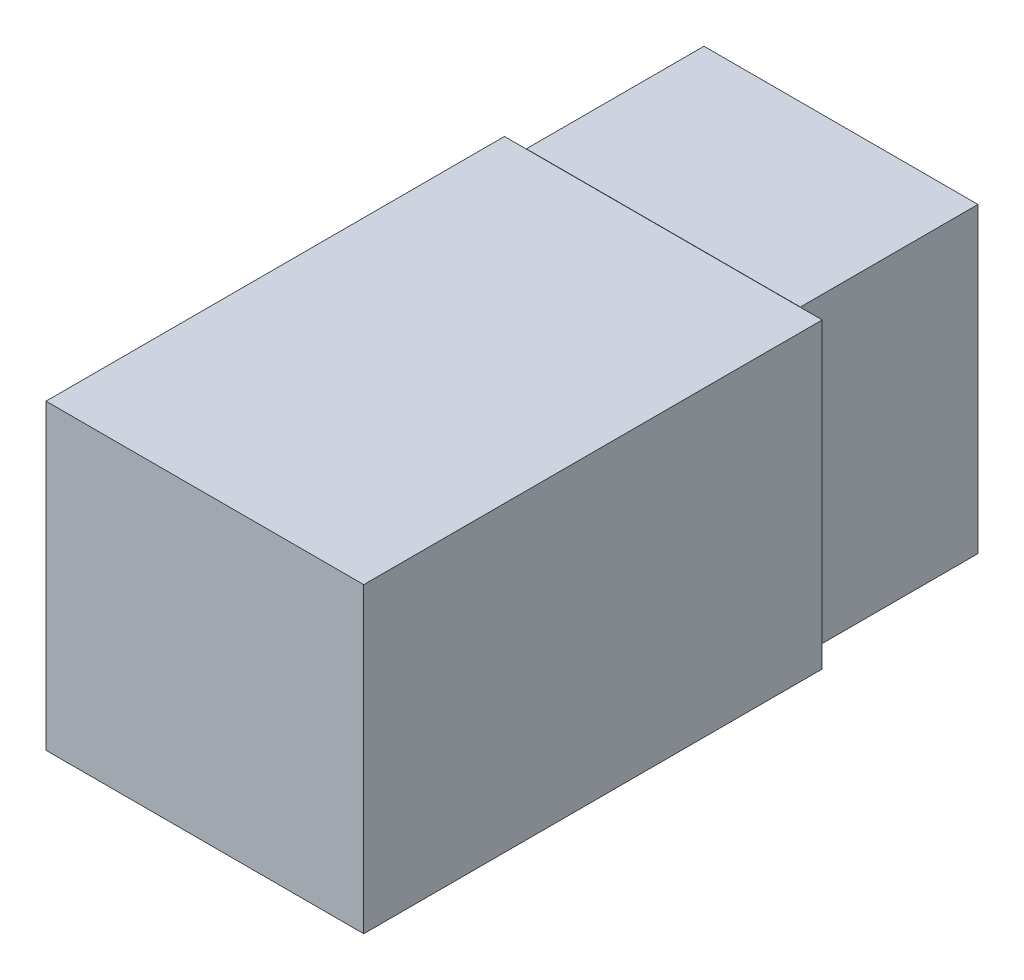
ISO-10303-21;
HEADER;
FILE_DESCRIPTION(('STEP AP214'),'2;1');
FILE_NAME('part.step','',(''),(''),'','','');
FILE_SCHEMA(('AUTOMOTIVE_DESIGN { 1 0 10303 214 1 1 1 1 }'));
ENDSEC;
DATA;
#1=APPLICATION_CONTEXT('core data for automotive mechanical design processes');
#2=APPLICATION_PROTOCOL_DEFINITION('international standard','automotive_design',2000,#1);
#3=PRODUCT_CONTEXT('',#1,'mechanical');
#4=PRODUCT('Part','Part','',(#3));
#5=PRODUCT_RELATED_PRODUCT_CATEGORY('part','',(#4));
#6=PRODUCT_DEFINITION_FORMATION('','',#4);
#7=PRODUCT_DEFINITION_CONTEXT('part definition',#1,'design');
#8=PRODUCT_DEFINITION('design','',#6,#7);
#9=PRODUCT_DEFINITION_SHAPE('','',#8);
#10=(LENGTH_UNIT() NAMED_UNIT(*) SI_UNIT(.MILLI.,.METRE.));
#11=(NAMED_UNIT(*) PLANE_ANGLE_UNIT() SI_UNIT($,.RADIAN.));
#12=(NAMED_UNIT(*) SI_UNIT($,.STERADIAN.) SOLID_ANGLE_UNIT());
#13=UNCERTAINTY_MEASURE_WITH_UNIT(LENGTH_MEASURE(1.E-05),#10,'distance_accuracy_value','');
#14=(GEOMETRIC_REPRESENTATION_CONTEXT(3) GLOBAL_UNCERTAINTY_ASSIGNED_CONTEXT((#13)) GLOBAL_UNIT_ASSIGNED_CONTEXT((#10,
#11,#12)) REPRESENTATION_CONTEXT('',''));
#15=CARTESIAN_POINT('',(0.,0.,0.));
#16=DIRECTION('',(0.,0.,1.));
#17=DIRECTION('',(1.,0.,0.));
#18=AXIS2_PLACEMENT_3D('',#15,#16,#17);
#19=CARTESIAN_POINT('',(0.,0.,0.));
#20=DIRECTION('',(0.,0.,-1.));
#21=DIRECTION('',(-1.,0.,0.));
#22=AXIS2_PLACEMENT_3D('',#19,#20,#21);
#23=PLANE('',#22);
#24=DIRECTION('',(0.,-1.,0.));
#25=VECTOR('',#24,1.);
#26=CARTESIAN_POINT('',(0.,0.,0.));
#27=LINE('',#26,#25);
#28=CARTESIAN_POINT('',(0.,16.,0.));
#29=VERTEX_POINT('',#28);
#30=CARTESIAN_POINT('',(0.,0.,0.));
#31=VERTEX_POINT('',#30);
#32=EDGE_CURVE('E285',#29,#31,#27,.T.);
#33=ORIENTED_EDGE('',*,*,#32,.F.);
#34=DIRECTION('',(-1.,0.,0.));
#35=VECTOR('',#34,1.);
#36=CARTESIAN_POINT('',(0.,16.,0.));
#37=LINE('',#36,#35);
#38=CARTESIAN_POINT('',(14.5,16.,0.));
#39=VERTEX_POINT('',#38);
#40=EDGE_CURVE('E305',#39,#29,#37,.T.);
#41=ORIENTED_EDGE('',*,*,#40,.F.);
#42=DIRECTION('',(0.,1.,0.));
#43=VECTOR('',#42,1.);
#44=CARTESIAN_POINT('',(14.5,0.,0.));
#45=LINE('',#44,#43);
#46=CARTESIAN_POINT('',(14.5,0.,0.));
#47=VERTEX_POINT('',#46);
#48=EDGE_CURVE('E303',#47,#39,#45,.T.);
#49=ORIENTED_EDGE('',*,*,#48,.F.);
#50=DIRECTION('',(1.,0.,0.));
#51=VECTOR('',#50,1.);
#52=CARTESIAN_POINT('',(0.,0.,0.));
#53=LINE('',#52,#51);
#54=EDGE_CURVE('E301',#31,#47,#53,.T.);
#55=ORIENTED_EDGE('',*,*,#54,.F.);
#56=EDGE_LOOP('',(#33,#41,#49,#55));
#57=FACE_BOUND('',#56,.T.);
#58=DIRECTION('',(-1.,0.,0.));
#59=VECTOR('',#58,1.);
#60=CARTESIAN_POINT('',(0.,14.7,0.));
#61=LINE('',#60,#59);
#62=CARTESIAN_POINT('',(13.2,14.7,0.));
#63=VERTEX_POINT('',#62);
#64=CARTESIAN_POINT('',(1.3,14.7,0.));
#65=VERTEX_POINT('',#64);
#66=EDGE_CURVE('E188',#63,#65,#61,.T.);
#67=ORIENTED_EDGE('',*,*,#66,.T.);
#68=DIRECTION('',(0.,-1.,0.));
#69=VECTOR('',#68,1.);
#70=CARTESIAN_POINT('',(1.3,0.,0.));
#71=LINE('',#70,#69);
#72=CARTESIAN_POINT('',(1.3,1.3,0.));
#73=VERTEX_POINT('',#72);
#74=EDGE_CURVE('E227',#65,#73,#71,.T.);
#75=ORIENTED_EDGE('',*,*,#74,.T.);
#76=DIRECTION('',(1.,0.,0.));
#77=VECTOR('',#76,1.);
#78=CARTESIAN_POINT('',(0.,1.3,0.));
#79=LINE('',#78,#77);
#80=CARTESIAN_POINT('',(13.2,1.3,0.));
#81=VERTEX_POINT('',#80);
#82=EDGE_CURVE('E252',#73,#81,#79,.T.);
#83=ORIENTED_EDGE('',*,*,#82,.T.);
#84=DIRECTION('',(0.,1.,0.));
#85=VECTOR('',#84,1.);
#86=CARTESIAN_POINT('',(13.2,0.,0.));
#87=LINE('',#86,#85);
#88=EDGE_CURVE('E56',#81,#63,#87,.T.);
#89=ORIENTED_EDGE('',*,*,#88,.T.);
#90=EDGE_LOOP('',(#67,#75,#83,#89));
#91=FACE_BOUND('',#90,.T.);
#92=ADVANCED_FACE('F38',(#57,#91),#23,.T.);
#93=CARTESIAN_POINT('',(0.,0.,9.4));
#94=DIRECTION('',(0.,0.,-1.));
#95=DIRECTION('',(-1.,0.,0.));
#96=AXIS2_PLACEMENT_3D('',#93,#94,#95);
#97=PLANE('',#96);
#98=DIRECTION('',(-1.,0.,0.));
#99=VECTOR('',#98,1.);
#100=CARTESIAN_POINT('',(-1.15750269123183,15.9863090292345,9.4));
#101=LINE('',#100,#99);
#102=CARTESIAN_POINT('',(14.5,15.9863090292345,9.4));
#103=VERTEX_POINT('',#102);
#104=CARTESIAN_POINT('',(0.,15.9863090292345,9.4));
#105=VERTEX_POINT('',#104);
#106=EDGE_CURVE('E11',#103,#105,#101,.T.);
#107=ORIENTED_EDGE('',*,*,#106,.F.);
#108=DIRECTION('',(0.,1.,0.));
#109=VECTOR('',#108,1.);
#110=CARTESIAN_POINT('',(14.5,0.,9.4));
#111=LINE('',#110,#109);
#112=CARTESIAN_POINT('',(14.5,16.,9.4));
#113=VERTEX_POINT('',#112);
#114=EDGE_CURVE('E292',#103,#113,#111,.T.);
#115=ORIENTED_EDGE('',*,*,#114,.T.);
#116=DIRECTION('',(-1.,0.,0.));
#117=VECTOR('',#116,1.);
#118=CARTESIAN_POINT('',(0.,16.,9.4));
#119=LINE('',#118,#117);
#120=CARTESIAN_POINT('',(0.,16.,9.4));
#121=VERTEX_POINT('',#120);
#122=EDGE_CURVE('E296',#113,#121,#119,.T.);
#123=ORIENTED_EDGE('',*,*,#122,.T.);
#124=DIRECTION('',(0.,-1.,0.));
#125=VECTOR('',#124,1.);
#126=CARTESIAN_POINT('',(0.,0.,9.4));
#127=LINE('',#126,#125);
#128=EDGE_CURVE('E286',#121,#105,#127,.T.);
#129=ORIENTED_EDGE('',*,*,#128,.T.);
#130=EDGE_LOOP('',(#107,#115,#123,#129));
#131=FACE_BOUND('',#130,.T.);
#132=ADVANCED_FACE('F334',(#131),#97,.F.);
#133=CARTESIAN_POINT('',(0.,0.,9.4));
#134=DIRECTION('',(1.,0.,0.));
#135=DIRECTION('',(0.,0.,-1.));
#136=AXIS2_PLACEMENT_3D('',#133,#134,#135);
#137=PLANE('',#136);
#138=ORIENTED_EDGE('',*,*,#32,.T.);
#139=DIRECTION('',(0.,0.,-1.));
#140=VECTOR('',#139,1.);
#141=CARTESIAN_POINT('',(0.,0.,9.4));
#142=LINE('',#141,#140);
#143=CARTESIAN_POINT('',(0.,0.,9.4));
#144=VERTEX_POINT('',#143);
#145=EDGE_CURVE('E42',#144,#31,#142,.T.);
#146=ORIENTED_EDGE('',*,*,#145,.F.);
#147=EDGE_CURVE('E289',#105,#144,#127,.T.);
#148=ORIENTED_EDGE('',*,*,#147,.F.);
#149=ORIENTED_EDGE('',*,*,#128,.F.);
#150=DIRECTION('',(0.,0.,-1.));
#151=VECTOR('',#150,1.);
#152=CARTESIAN_POINT('',(0.,16.,9.4));
#153=LINE('',#152,#151);
#154=EDGE_CURVE('E298',#121,#29,#153,.T.);
#155=ORIENTED_EDGE('',*,*,#154,.T.);
#156=EDGE_LOOP('',(#138,#146,#148,#149,#155));
#157=FACE_BOUND('',#156,.T.);
#158=ADVANCED_FACE('F40',(#157),#137,.F.);
#159=CARTESIAN_POINT('',(0.,0.,9.4));
#160=DIRECTION('',(0.,1.,0.));
#161=DIRECTION('',(0.,0.,1.));
#162=AXIS2_PLACEMENT_3D('',#159,#160,#161);
#163=PLANE('',#162);
#164=ORIENTED_EDGE('',*,*,#54,.T.);
#165=DIRECTION('',(0.,0.,-1.));
#166=VECTOR('',#165,1.);
#167=CARTESIAN_POINT('',(14.5,0.,9.4));
#168=LINE('',#167,#166);
#169=CARTESIAN_POINT('',(14.5,0.,9.4));
#170=VERTEX_POINT('',#169);
#171=EDGE_CURVE('E311',#170,#47,#168,.T.);
#172=ORIENTED_EDGE('',*,*,#171,.F.);
#173=DIRECTION('',(1.,0.,0.));
#174=VECTOR('',#173,1.);
#175=CARTESIAN_POINT('',(0.,0.,9.4));
#176=LINE('',#175,#174);
#177=EDGE_CURVE('E288',#144,#170,#176,.T.);
#178=ORIENTED_EDGE('',*,*,#177,.F.);
#179=ORIENTED_EDGE('',*,*,#145,.T.);
#180=EDGE_LOOP('',(#164,#172,#178,#179));
#181=FACE_BOUND('',#180,.T.);
#182=ADVANCED_FACE('F319',(#181),#163,.F.);
#183=CARTESIAN_POINT('',(14.5,0.,9.4));
#184=DIRECTION('',(-1.,0.,0.));
#185=DIRECTION('',(0.,0.,1.));
#186=AXIS2_PLACEMENT_3D('',#183,#184,#185);
#187=PLANE('',#186);
#188=ORIENTED_EDGE('',*,*,#48,.T.);
#189=DIRECTION('',(0.,0.,-1.));
#190=VECTOR('',#189,1.);
#191=CARTESIAN_POINT('',(14.5,16.,9.4));
#192=LINE('',#191,#190);
#193=EDGE_CURVE('E309',#113,#39,#192,.T.);
#194=ORIENTED_EDGE('',*,*,#193,.F.);
#195=ORIENTED_EDGE('',*,*,#114,.F.);
#196=EDGE_CURVE('E293',#170,#103,#111,.T.);
#197=ORIENTED_EDGE('',*,*,#196,.F.);
#198=ORIENTED_EDGE('',*,*,#171,.T.);
#199=EDGE_LOOP('',(#188,#194,#195,#197,#198));
#200=FACE_BOUND('',#199,.T.);
#201=ADVANCED_FACE('F330',(#200),#187,.F.);
#202=CARTESIAN_POINT('',(0.,16.,9.4));
#203=DIRECTION('',(0.,-1.,0.));
#204=DIRECTION('',(0.,0.,-1.));
#205=AXIS2_PLACEMENT_3D('',#202,#203,#204);
#206=PLANE('',#205);
#207=ORIENTED_EDGE('',*,*,#40,.T.);
#208=ORIENTED_EDGE('',*,*,#154,.F.);
#209=ORIENTED_EDGE('',*,*,#122,.F.);
#210=ORIENTED_EDGE('',*,*,#193,.T.);
#211=EDGE_LOOP('',(#207,#208,#209,#210));
#212=FACE_BOUND('',#211,.T.);
#213=ADVANCED_FACE('F333',(#212),#206,.F.);
#214=CARTESIAN_POINT('',(0.,0.,9.4));
#215=DIRECTION('',(0.,0.,1.));
#216=DIRECTION('',(1.,0.,0.));
#217=AXIS2_PLACEMENT_3D('',#214,#215,#216);
#218=PLANE('',#217);
#219=CARTESIAN_POINT('',(-1.15750269123183,15.9863090292345,9.4));
#220=VERTEX_POINT('',#219);
#221=EDGE_CURVE('E49',#105,#220,#101,.T.);
#222=ORIENTED_EDGE('',*,*,#221,.F.);
#223=ORIENTED_EDGE('',*,*,#147,.T.);
#224=ORIENTED_EDGE('',*,*,#177,.T.);
#225=ORIENTED_EDGE('',*,*,#196,.T.);
#226=CARTESIAN_POINT('',(15.6564374737797,15.9863090292345,9.4));
#227=VERTEX_POINT('',#226);
#228=EDGE_CURVE('E48',#227,#103,#101,.T.);
#229=ORIENTED_EDGE('',*,*,#228,.F.);
#230=DIRECTION('',(0.,1.,0.));
#231=VECTOR('',#230,1.);
#232=CARTESIAN_POINT('',(15.6564374737797,15.9863090292345,9.4));
#233=LINE('',#232,#231);
#234=CARTESIAN_POINT('',(15.6564374737798,-0.0136909707654786,9.4));
#235=VERTEX_POINT('',#234);
#236=EDGE_CURVE('E271',#235,#227,#233,.T.);
#237=ORIENTED_EDGE('',*,*,#236,.F.);
#238=DIRECTION('',(1.,0.,0.));
#239=VECTOR('',#238,1.);
#240=CARTESIAN_POINT('',(-1.15750269123183,-0.0136909707654786,9.4));
#241=LINE('',#240,#239);
#242=CARTESIAN_POINT('',(-1.15750269123183,-0.0136909707654786,9.4));
#243=VERTEX_POINT('',#242);
#244=EDGE_CURVE('E269',#243,#235,#241,.T.);
#245=ORIENTED_EDGE('',*,*,#244,.F.);
#246=DIRECTION('',(0.,-1.,0.));
#247=VECTOR('',#246,1.);
#248=CARTESIAN_POINT('',(-1.15750269123183,15.9863090292345,9.4));
#249=LINE('',#248,#247);
#250=EDGE_CURVE('E249',#220,#243,#249,.T.);
#251=ORIENTED_EDGE('',*,*,#250,.F.);
#252=EDGE_LOOP('',(#222,#223,#224,#225,#229,#237,#245,#251));
#253=FACE_BOUND('',#252,.T.);
#254=ADVANCED_FACE('F338',(#253),#218,.F.);
#255=CARTESIAN_POINT('',(-1.15750269123183,15.9863090292345,33.66));
#256=DIRECTION('',(1.,0.,0.));
#257=DIRECTION('',(0.,1.,0.));
#258=AXIS2_PLACEMENT_3D('',#255,#256,#257);
#259=PLANE('',#258);
#260=ORIENTED_EDGE('',*,*,#250,.T.);
#261=DIRECTION('',(0.,0.,-1.));
#262=VECTOR('',#261,1.);
#263=CARTESIAN_POINT('',(-1.15750269123183,-0.0136909707654786,33.66));
#264=LINE('',#263,#262);
#265=CARTESIAN_POINT('',(-1.15750269123183,-0.0136909707654786,33.66));
#266=VERTEX_POINT('',#265);
#267=EDGE_CURVE('E282',#266,#243,#264,.T.);
#268=ORIENTED_EDGE('',*,*,#267,.F.);
#269=DIRECTION('',(0.,-1.,0.));
#270=VECTOR('',#269,1.);
#271=CARTESIAN_POINT('',(-1.15750269123183,15.9863090292345,33.66));
#272=LINE('',#271,#270);
#273=CARTESIAN_POINT('',(-1.15750269123183,15.9863090292345,33.66));
#274=VERTEX_POINT('',#273);
#275=EDGE_CURVE('E257',#274,#266,#272,.T.);
#276=ORIENTED_EDGE('',*,*,#275,.F.);
#277=DIRECTION('',(0.,0.,-1.));
#278=VECTOR('',#277,1.);
#279=CARTESIAN_POINT('',(-1.15750269123183,15.9863090292345,33.66));
#280=LINE('',#279,#278);
#281=EDGE_CURVE('E266',#274,#220,#280,.T.);
#282=ORIENTED_EDGE('',*,*,#281,.T.);
#283=EDGE_LOOP('',(#260,#268,#276,#282));
#284=FACE_BOUND('',#283,.T.);
#285=ADVANCED_FACE('F355',(#284),#259,.F.);
#286=CARTESIAN_POINT('',(-1.15750269123183,-0.0136909707654786,33.66));
#287=DIRECTION('',(0.,1.,0.));
#288=DIRECTION('',(0.,0.,1.));
#289=AXIS2_PLACEMENT_3D('',#286,#287,#288);
#290=PLANE('',#289);
#291=ORIENTED_EDGE('',*,*,#244,.T.);
#292=DIRECTION('',(0.,0.,-1.));
#293=VECTOR('',#292,1.);
#294=CARTESIAN_POINT('',(15.6564374737798,-0.0136909707654786,33.66));
#295=LINE('',#294,#293);
#296=CARTESIAN_POINT('',(15.6564374737798,-0.0136909707654786,33.66));
#297=VERTEX_POINT('',#296);
#298=EDGE_CURVE('E279',#297,#235,#295,.T.);
#299=ORIENTED_EDGE('',*,*,#298,.F.);
#300=DIRECTION('',(1.,0.,0.));
#301=VECTOR('',#300,1.);
#302=CARTESIAN_POINT('',(-1.15750269123183,-0.0136909707654786,33.66));
#303=LINE('',#302,#301);
#304=EDGE_CURVE('E260',#266,#297,#303,.T.);
#305=ORIENTED_EDGE('',*,*,#304,.F.);
#306=ORIENTED_EDGE('',*,*,#267,.T.);
#307=EDGE_LOOP('',(#291,#299,#305,#306));
#308=FACE_BOUND('',#307,.T.);
#309=ADVANCED_FACE('F352',(#308),#290,.F.);
#310=CARTESIAN_POINT('',(15.6564374737797,15.9863090292345,33.66));
#311=DIRECTION('',(-1.,0.,0.));
#312=DIRECTION('',(0.,-1.,0.));
#313=AXIS2_PLACEMENT_3D('',#310,#311,#312);
#314=PLANE('',#313);
#315=ORIENTED_EDGE('',*,*,#236,.T.);
#316=DIRECTION('',(0.,0.,-1.));
#317=VECTOR('',#316,1.);
#318=CARTESIAN_POINT('',(15.6564374737797,15.9863090292345,33.66));
#319=LINE('',#318,#317);
#320=CARTESIAN_POINT('',(15.6564374737797,15.9863090292345,33.66));
#321=VERTEX_POINT('',#320);
#322=EDGE_CURVE('E276',#321,#227,#319,.T.);
#323=ORIENTED_EDGE('',*,*,#322,.F.);
#324=DIRECTION('',(0.,1.,0.));
#325=VECTOR('',#324,1.);
#326=CARTESIAN_POINT('',(15.6564374737797,15.9863090292345,33.66));
#327=LINE('',#326,#325);
#328=EDGE_CURVE('E262',#297,#321,#327,.T.);
#329=ORIENTED_EDGE('',*,*,#328,.F.);
#330=ORIENTED_EDGE('',*,*,#298,.T.);
#331=EDGE_LOOP('',(#315,#323,#329,#330));
#332=FACE_BOUND('',#331,.T.);
#333=ADVANCED_FACE('F347',(#332),#314,.F.);
#334=CARTESIAN_POINT('',(-1.15750269123183,15.9863090292345,33.66));
#335=DIRECTION('',(0.,-1.,0.));
#336=DIRECTION('',(0.,0.,-1.));
#337=AXIS2_PLACEMENT_3D('',#334,#335,#336);
#338=PLANE('',#337);
#339=ORIENTED_EDGE('',*,*,#228,.T.);
#340=ORIENTED_EDGE('',*,*,#106,.T.);
#341=ORIENTED_EDGE('',*,*,#221,.T.);
#342=ORIENTED_EDGE('',*,*,#281,.F.);
#343=DIRECTION('',(-1.,0.,0.));
#344=VECTOR('',#343,1.);
#345=CARTESIAN_POINT('',(-1.15750269123183,15.9863090292345,33.66));
#346=LINE('',#345,#344);
#347=EDGE_CURVE('E264',#321,#274,#346,.T.);
#348=ORIENTED_EDGE('',*,*,#347,.F.);
#349=ORIENTED_EDGE('',*,*,#322,.T.);
#350=EDGE_LOOP('',(#339,#340,#341,#342,#348,#349));
#351=FACE_BOUND('',#350,.T.);
#352=ADVANCED_FACE('F341',(#351),#338,.F.);
#353=CARTESIAN_POINT('',(0.,0.,33.66));
#354=DIRECTION('',(0.,0.,1.));
#355=DIRECTION('',(1.,0.,0.));
#356=AXIS2_PLACEMENT_3D('',#353,#354,#355);
#357=PLANE('',#356);
#358=ORIENTED_EDGE('',*,*,#275,.T.);
#359=ORIENTED_EDGE('',*,*,#304,.T.);
#360=ORIENTED_EDGE('',*,*,#328,.T.);
#361=ORIENTED_EDGE('',*,*,#347,.T.);
#362=EDGE_LOOP('',(#358,#359,#360,#361));
#363=FACE_BOUND('',#362,.T.);
#364=ADVANCED_FACE('F357',(#363),#357,.T.);
#365=CARTESIAN_POINT('',(0.,0.,8.1));
#366=DIRECTION('',(0.,0.,-1.));
#367=DIRECTION('',(-1.,0.,0.));
#368=AXIS2_PLACEMENT_3D('',#365,#366,#367);
#369=PLANE('',#368);
#370=DIRECTION('',(-1.,0.,0.));
#371=VECTOR('',#370,1.);
#372=CARTESIAN_POINT('',(0.,14.6863090292345,8.1));
#373=LINE('',#372,#371);
#374=CARTESIAN_POINT('',(13.2,14.6863090292345,8.1));
#375=VERTEX_POINT('',#374);
#376=CARTESIAN_POINT('',(1.3,14.6863090292345,8.1));
#377=VERTEX_POINT('',#376);
#378=EDGE_CURVE('E206',#375,#377,#373,.T.);
#379=ORIENTED_EDGE('',*,*,#378,.T.);
#380=DIRECTION('',(0.,-1.,0.));
#381=VECTOR('',#380,1.);
#382=CARTESIAN_POINT('',(1.3,0.,8.1));
#383=LINE('',#382,#381);
#384=CARTESIAN_POINT('',(1.3,14.7,8.1));
#385=VERTEX_POINT('',#384);
#386=EDGE_CURVE('E195',#385,#377,#383,.T.);
#387=ORIENTED_EDGE('',*,*,#386,.F.);
#388=DIRECTION('',(-1.,0.,0.));
#389=VECTOR('',#388,1.);
#390=CARTESIAN_POINT('',(0.,14.7,8.1));
#391=LINE('',#390,#389);
#392=CARTESIAN_POINT('',(13.2,14.7,8.1));
#393=VERTEX_POINT('',#392);
#394=EDGE_CURVE('E185',#393,#385,#391,.T.);
#395=ORIENTED_EDGE('',*,*,#394,.F.);
#396=DIRECTION('',(0.,1.,0.));
#397=VECTOR('',#396,1.);
#398=CARTESIAN_POINT('',(13.2,0.,8.1));
#399=LINE('',#398,#397);
#400=EDGE_CURVE('E168',#375,#393,#399,.T.);
#401=ORIENTED_EDGE('',*,*,#400,.F.);
#402=EDGE_LOOP('',(#379,#387,#395,#401));
#403=FACE_BOUND('',#402,.T.);
#404=ADVANCED_FACE('F193',(#403),#369,.T.);
#405=CARTESIAN_POINT('',(1.3,0.,9.4));
#406=DIRECTION('',(1.,0.,0.));
#407=DIRECTION('',(0.,0.,-1.));
#408=AXIS2_PLACEMENT_3D('',#405,#406,#407);
#409=PLANE('',#408);
#410=ORIENTED_EDGE('',*,*,#74,.F.);
#411=DIRECTION('',(0.,0.,-1.));
#412=VECTOR('',#411,1.);
#413=CARTESIAN_POINT('',(1.3,14.7,9.4));
#414=LINE('',#413,#412);
#415=EDGE_CURVE('E190',#385,#65,#414,.T.);
#416=ORIENTED_EDGE('',*,*,#415,.F.);
#417=ORIENTED_EDGE('',*,*,#386,.T.);
#418=DIRECTION('',(0.,0.,1.));
#419=VECTOR('',#418,1.);
#420=CARTESIAN_POINT('',(1.3,14.6863090292345,33.66));
#421=LINE('',#420,#419);
#422=CARTESIAN_POINT('',(1.3,14.6863090292345,10.7));
#423=VERTEX_POINT('',#422);
#424=EDGE_CURVE('E245',#377,#423,#421,.T.);
#425=ORIENTED_EDGE('',*,*,#424,.T.);
#426=DIRECTION('',(0.,-1.,0.));
#427=VECTOR('',#426,1.);
#428=CARTESIAN_POINT('',(1.3,0.,10.7));
#429=LINE('',#428,#427);
#430=CARTESIAN_POINT('',(1.3,1.3,10.7));
#431=VERTEX_POINT('',#430);
#432=EDGE_CURVE('E202',#423,#431,#429,.T.);
#433=ORIENTED_EDGE('',*,*,#432,.T.);
#434=DIRECTION('',(0.,0.,-1.));
#435=VECTOR('',#434,1.);
#436=CARTESIAN_POINT('',(1.3,1.3,9.4));
#437=LINE('',#436,#435);
#438=EDGE_CURVE('E203',#431,#73,#437,.T.);
#439=ORIENTED_EDGE('',*,*,#438,.T.);
#440=EDGE_LOOP('',(#410,#416,#417,#425,#433,#439));
#441=FACE_BOUND('',#440,.T.);
#442=ADVANCED_FACE('F365',(#441),#409,.T.);
#443=CARTESIAN_POINT('',(0.,1.3,9.4));
#444=DIRECTION('',(0.,1.,0.));
#445=DIRECTION('',(0.,0.,1.));
#446=AXIS2_PLACEMENT_3D('',#443,#444,#445);
#447=PLANE('',#446);
#448=ORIENTED_EDGE('',*,*,#82,.F.);
#449=ORIENTED_EDGE('',*,*,#438,.F.);
#450=DIRECTION('',(1.,0.,0.));
#451=VECTOR('',#450,1.);
#452=CARTESIAN_POINT('',(0.,1.3,10.7));
#453=LINE('',#452,#451);
#454=CARTESIAN_POINT('',(13.2,1.3,10.7));
#455=VERTEX_POINT('',#454);
#456=EDGE_CURVE('E181',#431,#455,#453,.T.);
#457=ORIENTED_EDGE('',*,*,#456,.T.);
#458=DIRECTION('',(0.,0.,-1.));
#459=VECTOR('',#458,1.);
#460=CARTESIAN_POINT('',(13.2,1.3,9.4));
#461=LINE('',#460,#459);
#462=EDGE_CURVE('E189',#455,#81,#461,.T.);
#463=ORIENTED_EDGE('',*,*,#462,.T.);
#464=EDGE_LOOP('',(#448,#449,#457,#463));
#465=FACE_BOUND('',#464,.T.);
#466=ADVANCED_FACE('F455',(#465),#447,.T.);
#467=CARTESIAN_POINT('',(13.2,0.,9.4));
#468=DIRECTION('',(-1.,0.,0.));
#469=DIRECTION('',(0.,0.,1.));
#470=AXIS2_PLACEMENT_3D('',#467,#468,#469);
#471=PLANE('',#470);
#472=ORIENTED_EDGE('',*,*,#88,.F.);
#473=ORIENTED_EDGE('',*,*,#462,.F.);
#474=DIRECTION('',(0.,1.,0.));
#475=VECTOR('',#474,1.);
#476=CARTESIAN_POINT('',(13.2,0.,10.7));
#477=LINE('',#476,#475);
#478=CARTESIAN_POINT('',(13.2,14.6863090292345,10.7));
#479=VERTEX_POINT('',#478);
#480=EDGE_CURVE('E180',#455,#479,#477,.T.);
#481=ORIENTED_EDGE('',*,*,#480,.T.);
#482=DIRECTION('',(0.,0.,1.));
#483=VECTOR('',#482,1.);
#484=CARTESIAN_POINT('',(13.2,14.6863090292345,9.4));
#485=LINE('',#484,#483);
#486=EDGE_CURVE('E175',#375,#479,#485,.T.);
#487=ORIENTED_EDGE('',*,*,#486,.F.);
#488=ORIENTED_EDGE('',*,*,#400,.T.);
#489=DIRECTION('',(0.,0.,-1.));
#490=VECTOR('',#489,1.);
#491=CARTESIAN_POINT('',(13.2,14.7,9.4));
#492=LINE('',#491,#490);
#493=EDGE_CURVE('E171',#393,#63,#492,.T.);
#494=ORIENTED_EDGE('',*,*,#493,.T.);
#495=EDGE_LOOP('',(#472,#473,#481,#487,#488,#494));
#496=FACE_BOUND('',#495,.T.);
#497=ADVANCED_FACE('F170',(#496),#471,.T.);
#498=CARTESIAN_POINT('',(0.,14.7,9.4));
#499=DIRECTION('',(0.,-1.,0.));
#500=DIRECTION('',(0.,0.,-1.));
#501=AXIS2_PLACEMENT_3D('',#498,#499,#500);
#502=PLANE('',#501);
#503=ORIENTED_EDGE('',*,*,#66,.F.);
#504=ORIENTED_EDGE('',*,*,#493,.F.);
#505=ORIENTED_EDGE('',*,*,#394,.T.);
#506=ORIENTED_EDGE('',*,*,#415,.T.);
#507=EDGE_LOOP('',(#503,#504,#505,#506));
#508=FACE_BOUND('',#507,.T.);
#509=ADVANCED_FACE('F184',(#508),#502,.T.);
#510=CARTESIAN_POINT('',(0.,0.,10.7));
#511=DIRECTION('',(0.,0.,1.));
#512=DIRECTION('',(1.,0.,0.));
#513=AXIS2_PLACEMENT_3D('',#510,#511,#512);
#514=PLANE('',#513);
#515=DIRECTION('',(-1.,0.,0.));
#516=VECTOR('',#515,1.);
#517=CARTESIAN_POINT('',(-1.15750269123183,14.6863090292345,10.7));
#518=LINE('',#517,#516);
#519=CARTESIAN_POINT('',(0.142497308768173,14.6863090292345,10.7));
#520=VERTEX_POINT('',#519);
#521=EDGE_CURVE('E212',#423,#520,#518,.T.);
#522=ORIENTED_EDGE('',*,*,#521,.T.);
#523=DIRECTION('',(0.,-1.,0.));
#524=VECTOR('',#523,1.);
#525=CARTESIAN_POINT('',(0.142497308768173,15.9863090292345,10.7));
#526=LINE('',#525,#524);
#527=CARTESIAN_POINT('',(0.142497308768175,1.28630902923452,10.7));
#528=VERTEX_POINT('',#527);
#529=EDGE_CURVE('E221',#520,#528,#526,.T.);
#530=ORIENTED_EDGE('',*,*,#529,.T.);
#531=DIRECTION('',(1.,0.,0.));
#532=VECTOR('',#531,1.);
#533=CARTESIAN_POINT('',(-1.15750269123183,1.28630902923452,10.7));
#534=LINE('',#533,#532);
#535=CARTESIAN_POINT('',(14.3564374737798,1.28630902923452,10.7));
#536=VERTEX_POINT('',#535);
#537=EDGE_CURVE('E219',#528,#536,#534,.T.);
#538=ORIENTED_EDGE('',*,*,#537,.T.);
#539=DIRECTION('',(0.,1.,0.));
#540=VECTOR('',#539,1.);
#541=CARTESIAN_POINT('',(14.3564374737797,15.9863090292345,10.7));
#542=LINE('',#541,#540);
#543=CARTESIAN_POINT('',(14.3564374737797,14.6863090292345,10.7));
#544=VERTEX_POINT('',#543);
#545=EDGE_CURVE('E215',#536,#544,#542,.T.);
#546=ORIENTED_EDGE('',*,*,#545,.T.);
#547=DIRECTION('',(-1.,0.,0.));
#548=VECTOR('',#547,1.);
#549=CARTESIAN_POINT('',(-1.15750269123183,14.6863090292345,10.7));
#550=LINE('',#549,#548);
#551=EDGE_CURVE('E214',#544,#479,#550,.T.);
#552=ORIENTED_EDGE('',*,*,#551,.T.);
#553=ORIENTED_EDGE('',*,*,#480,.F.);
#554=ORIENTED_EDGE('',*,*,#456,.F.);
#555=ORIENTED_EDGE('',*,*,#432,.F.);
#556=EDGE_LOOP('',(#522,#530,#538,#546,#552,#553,#554,#555));
#557=FACE_BOUND('',#556,.T.);
#558=ADVANCED_FACE('F482',(#557),#514,.T.);
#559=CARTESIAN_POINT('',(0.142497308768173,15.9863090292345,33.66));
#560=DIRECTION('',(1.,0.,0.));
#561=DIRECTION('',(0.,1.,0.));
#562=AXIS2_PLACEMENT_3D('',#559,#560,#561);
#563=PLANE('',#562);
#564=ORIENTED_EDGE('',*,*,#529,.F.);
#565=DIRECTION('',(0.,0.,-1.));
#566=VECTOR('',#565,1.);
#567=CARTESIAN_POINT('',(0.142497308768173,14.6863090292345,33.66));
#568=LINE('',#567,#566);
#569=CARTESIAN_POINT('',(0.142497308768173,14.6863090292345,32.36));
#570=VERTEX_POINT('',#569);
#571=EDGE_CURVE('E232',#570,#520,#568,.T.);
#572=ORIENTED_EDGE('',*,*,#571,.F.);
#573=DIRECTION('',(0.,-1.,0.));
#574=VECTOR('',#573,1.);
#575=CARTESIAN_POINT('',(0.142497308768173,15.9863090292345,32.36));
#576=LINE('',#575,#574);
#577=CARTESIAN_POINT('',(0.142497308768175,1.28630902923452,32.36));
#578=VERTEX_POINT('',#577);
#579=EDGE_CURVE('E217',#570,#578,#576,.T.);
#580=ORIENTED_EDGE('',*,*,#579,.T.);
#581=DIRECTION('',(0.,0.,-1.));
#582=VECTOR('',#581,1.);
#583=CARTESIAN_POINT('',(0.142497308768175,1.28630902923452,33.66));
#584=LINE('',#583,#582);
#585=EDGE_CURVE('E224',#578,#528,#584,.T.);
#586=ORIENTED_EDGE('',*,*,#585,.T.);
#587=EDGE_LOOP('',(#564,#572,#580,#586));
#588=FACE_BOUND('',#587,.T.);
#589=ADVANCED_FACE('F491',(#588),#563,.T.);
#590=CARTESIAN_POINT('',(-1.15750269123183,1.28630902923452,33.66));
#591=DIRECTION('',(0.,1.,0.));
#592=DIRECTION('',(0.,0.,1.));
#593=AXIS2_PLACEMENT_3D('',#590,#591,#592);
#594=PLANE('',#593);
#595=ORIENTED_EDGE('',*,*,#537,.F.);
#596=ORIENTED_EDGE('',*,*,#585,.F.);
#597=DIRECTION('',(1.,0.,0.));
#598=VECTOR('',#597,1.);
#599=CARTESIAN_POINT('',(-1.15750269123183,1.28630902923452,32.36));
#600=LINE('',#599,#598);
#601=CARTESIAN_POINT('',(14.3564374737798,1.28630902923452,32.36));
#602=VERTEX_POINT('',#601);
#603=EDGE_CURVE('E231',#578,#602,#600,.T.);
#604=ORIENTED_EDGE('',*,*,#603,.T.);
#605=DIRECTION('',(0.,0.,-1.));
#606=VECTOR('',#605,1.);
#607=CARTESIAN_POINT('',(14.3564374737798,1.28630902923452,33.66));
#608=LINE('',#607,#606);
#609=EDGE_CURVE('E228',#602,#536,#608,.T.);
#610=ORIENTED_EDGE('',*,*,#609,.T.);
#611=EDGE_LOOP('',(#595,#596,#604,#610));
#612=FACE_BOUND('',#611,.T.);
#613=ADVANCED_FACE('F501',(#612),#594,.T.);
#614=CARTESIAN_POINT('',(14.3564374737797,15.9863090292345,33.66));
#615=DIRECTION('',(-1.,0.,0.));
#616=DIRECTION('',(0.,-1.,0.));
#617=AXIS2_PLACEMENT_3D('',#614,#615,#616);
#618=PLANE('',#617);
#619=ORIENTED_EDGE('',*,*,#545,.F.);
#620=ORIENTED_EDGE('',*,*,#609,.F.);
#621=DIRECTION('',(0.,1.,0.));
#622=VECTOR('',#621,1.);
#623=CARTESIAN_POINT('',(14.3564374737797,15.9863090292345,32.36));
#624=LINE('',#623,#622);
#625=CARTESIAN_POINT('',(14.3564374737797,14.6863090292345,32.36));
#626=VERTEX_POINT('',#625);
#627=EDGE_CURVE('E240',#602,#626,#624,.T.);
#628=ORIENTED_EDGE('',*,*,#627,.T.);
#629=DIRECTION('',(0.,0.,-1.));
#630=VECTOR('',#629,1.);
#631=CARTESIAN_POINT('',(14.3564374737797,14.6863090292345,33.66));
#632=LINE('',#631,#630);
#633=EDGE_CURVE('E235',#626,#544,#632,.T.);
#634=ORIENTED_EDGE('',*,*,#633,.T.);
#635=EDGE_LOOP('',(#619,#620,#628,#634));
#636=FACE_BOUND('',#635,.T.);
#637=ADVANCED_FACE('F511',(#636),#618,.T.);
#638=CARTESIAN_POINT('',(-1.15750269123183,14.6863090292345,33.66));
#639=DIRECTION('',(0.,-1.,0.));
#640=DIRECTION('',(0.,0.,-1.));
#641=AXIS2_PLACEMENT_3D('',#638,#639,#640);
#642=PLANE('',#641);
#643=ORIENTED_EDGE('',*,*,#551,.F.);
#644=ORIENTED_EDGE('',*,*,#633,.F.);
#645=DIRECTION('',(-1.,0.,0.));
#646=VECTOR('',#645,1.);
#647=CARTESIAN_POINT('',(-1.15750269123183,14.6863090292345,32.36));
#648=LINE('',#647,#646);
#649=EDGE_CURVE('E236',#626,#570,#648,.T.);
#650=ORIENTED_EDGE('',*,*,#649,.T.);
#651=ORIENTED_EDGE('',*,*,#571,.T.);
#652=ORIENTED_EDGE('',*,*,#521,.F.);
#653=ORIENTED_EDGE('',*,*,#424,.F.);
#654=ORIENTED_EDGE('',*,*,#378,.F.);
#655=ORIENTED_EDGE('',*,*,#486,.T.);
#656=EDGE_LOOP('',(#643,#644,#650,#651,#652,#653,#654,#655));
#657=FACE_BOUND('',#656,.T.);
#658=ADVANCED_FACE('F521',(#657),#642,.T.);
#659=CARTESIAN_POINT('',(0.,0.,32.36));
#660=DIRECTION('',(0.,0.,1.));
#661=DIRECTION('',(1.,0.,0.));
#662=AXIS2_PLACEMENT_3D('',#659,#660,#661);
#663=PLANE('',#662);
#664=ORIENTED_EDGE('',*,*,#579,.F.);
#665=ORIENTED_EDGE('',*,*,#649,.F.);
#666=ORIENTED_EDGE('',*,*,#627,.F.);
#667=ORIENTED_EDGE('',*,*,#603,.F.);
#668=EDGE_LOOP('',(#664,#665,#666,#667));
#669=FACE_BOUND('',#668,.T.);
#670=ADVANCED_FACE('F531',(#669),#663,.F.);
#671=CLOSED_SHELL('',(#92,#132,#158,#182,#201,#213,#254,#285,#309,#333,#352,#364,#404,#442,#466,
#497,#509,#558,#589,#613,#637,#658,#670));
#672=MANIFOLD_SOLID_BREP('B2',#671);
#673=ADVANCED_BREP_SHAPE_REPRESENTATION('',(#18,#672),#14);
#674=SHAPE_DEFINITION_REPRESENTATION(#9,#673);
ENDSEC;
END-ISO-10303-21;
